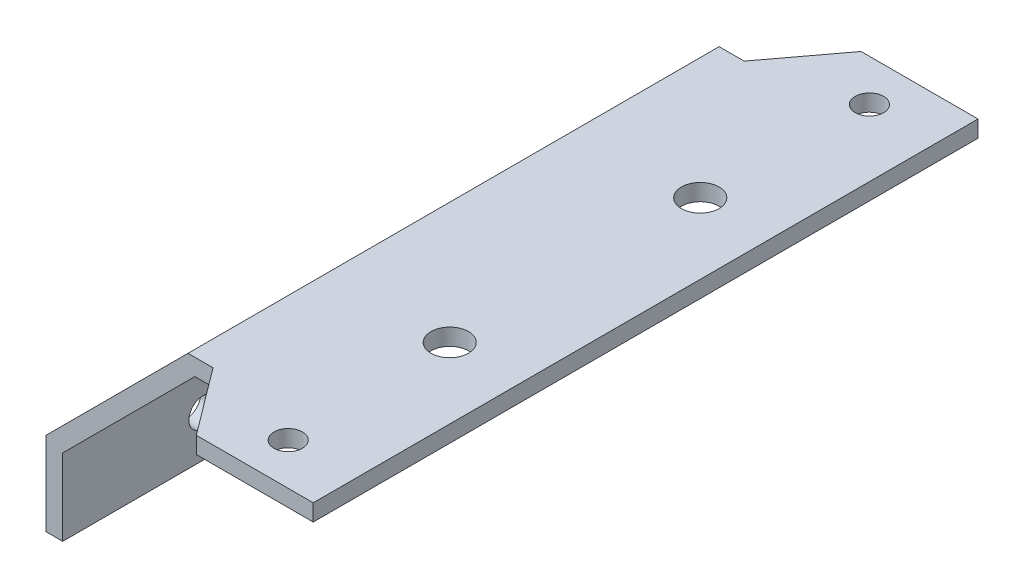
ISO-10303-21;
HEADER;
FILE_DESCRIPTION(('STEP AP214'),'2;1');
FILE_NAME('part.step','',(''),(''),'','','');
FILE_SCHEMA(('AUTOMOTIVE_DESIGN { 1 0 10303 214 1 1 1 1 }'));
ENDSEC;
DATA;
#1=APPLICATION_CONTEXT('core data for automotive mechanical design processes');
#2=APPLICATION_PROTOCOL_DEFINITION('international standard','automotive_design',2000,#1);
#3=PRODUCT_CONTEXT('',#1,'mechanical');
#4=PRODUCT('Part','Part','',(#3));
#5=PRODUCT_RELATED_PRODUCT_CATEGORY('part','',(#4));
#6=PRODUCT_DEFINITION_FORMATION('','',#4);
#7=PRODUCT_DEFINITION_CONTEXT('part definition',#1,'design');
#8=PRODUCT_DEFINITION('design','',#6,#7);
#9=PRODUCT_DEFINITION_SHAPE('','',#8);
#10=(LENGTH_UNIT() NAMED_UNIT(*) SI_UNIT(.MILLI.,.METRE.));
#11=(NAMED_UNIT(*) PLANE_ANGLE_UNIT() SI_UNIT($,.RADIAN.));
#12=(NAMED_UNIT(*) SI_UNIT($,.STERADIAN.) SOLID_ANGLE_UNIT());
#13=UNCERTAINTY_MEASURE_WITH_UNIT(LENGTH_MEASURE(1.E-05),#10,'distance_accuracy_value','');
#14=(GEOMETRIC_REPRESENTATION_CONTEXT(3) GLOBAL_UNCERTAINTY_ASSIGNED_CONTEXT((#13)) GLOBAL_UNIT_ASSIGNED_CONTEXT((#10,
#11,#12)) REPRESENTATION_CONTEXT('',''));
#15=CARTESIAN_POINT('',(0.,0.,0.));
#16=DIRECTION('',(0.,0.,1.));
#17=DIRECTION('',(1.,0.,0.));
#18=AXIS2_PLACEMENT_3D('',#15,#16,#17);
#19=CARTESIAN_POINT('',(0.,0.,-31.8));
#20=DIRECTION('',(0.,0.,1.));
#21=DIRECTION('',(1.,0.,0.));
#22=AXIS2_PLACEMENT_3D('',#19,#20,#21);
#23=PLANE('',#22);
#24=DIRECTION('',(0.,1.,0.));
#25=VECTOR('',#24,1.);
#26=CARTESIAN_POINT('',(18.,25.,-31.8));
#27=LINE('',#26,#25);
#28=CARTESIAN_POINT('',(18.,25.,-31.8));
#29=VERTEX_POINT('',#28);
#30=CARTESIAN_POINT('',(18.,27.,-31.8));
#31=VERTEX_POINT('',#30);
#32=EDGE_CURVE('E50',#29,#31,#27,.T.);
#33=ORIENTED_EDGE('',*,*,#32,.F.);
#34=DIRECTION('',(1.,0.,0.));
#35=VECTOR('',#34,1.);
#36=CARTESIAN_POINT('',(15.8284271247461,25.,-31.8));
#37=LINE('',#36,#35);
#38=CARTESIAN_POINT('',(15.8284271247461,25.,-31.8));
#39=VERTEX_POINT('',#38);
#40=EDGE_CURVE('E132',#39,#29,#37,.T.);
#41=ORIENTED_EDGE('',*,*,#40,.F.);
#42=DIRECTION('',(0.707106781186546,0.707106781186549,0.));
#43=VECTOR('',#42,1.);
#44=CARTESIAN_POINT('',(0.,9.17157287525381,-31.8));
#45=LINE('',#44,#43);
#46=CARTESIAN_POINT('',(0.,9.17157287525381,-31.8));
#47=VERTEX_POINT('',#46);
#48=EDGE_CURVE('E215',#47,#39,#45,.T.);
#49=ORIENTED_EDGE('',*,*,#48,.F.);
#50=DIRECTION('',(0.,1.,0.));
#51=VECTOR('',#50,1.);
#52=CARTESIAN_POINT('',(0.,0.,-31.8));
#53=LINE('',#52,#51);
#54=CARTESIAN_POINT('',(0.,0.,-31.8));
#55=VERTEX_POINT('',#54);
#56=EDGE_CURVE('E213',#55,#47,#53,.T.);
#57=ORIENTED_EDGE('',*,*,#56,.F.);
#58=DIRECTION('',(1.,0.,0.));
#59=VECTOR('',#58,1.);
#60=CARTESIAN_POINT('',(-2.,0.,-31.8));
#61=LINE('',#60,#59);
#62=CARTESIAN_POINT('',(-2.,0.,-31.8));
#63=VERTEX_POINT('',#62);
#64=EDGE_CURVE('E192',#63,#55,#61,.T.);
#65=ORIENTED_EDGE('',*,*,#64,.F.);
#66=DIRECTION('',(0.,-1.,0.));
#67=VECTOR('',#66,1.);
#68=CARTESIAN_POINT('',(-2.,10.,-31.8));
#69=LINE('',#68,#67);
#70=CARTESIAN_POINT('',(-2.,10.,-31.8));
#71=VERTEX_POINT('',#70);
#72=EDGE_CURVE('E197',#71,#63,#69,.T.);
#73=ORIENTED_EDGE('',*,*,#72,.F.);
#74=DIRECTION('',(-0.707106781186546,-0.707106781186549,0.));
#75=VECTOR('',#74,1.);
#76=CARTESIAN_POINT('',(14.9999999999999,27.,-31.8));
#77=LINE('',#76,#75);
#78=CARTESIAN_POINT('',(14.9999999999999,27.,-31.8));
#79=VERTEX_POINT('',#78);
#80=EDGE_CURVE('E220',#79,#71,#77,.T.);
#81=ORIENTED_EDGE('',*,*,#80,.F.);
#82=DIRECTION('',(-1.,0.,0.));
#83=VECTOR('',#82,1.);
#84=CARTESIAN_POINT('',(38.,27.,-31.8));
#85=LINE('',#84,#83);
#86=EDGE_CURVE('E218',#31,#79,#85,.T.);
#87=ORIENTED_EDGE('',*,*,#86,.F.);
#88=EDGE_LOOP('',(#33,#41,#49,#57,#65,#73,#81,#87));
#89=FACE_BOUND('',#88,.T.);
#90=ADVANCED_FACE('F33',(#89),#23,.F.);
#91=CARTESIAN_POINT('',(0.,0.,31.8));
#92=DIRECTION('',(0.,0.,1.));
#93=DIRECTION('',(1.,0.,0.));
#94=AXIS2_PLACEMENT_3D('',#91,#92,#93);
#95=PLANE('',#94);
#96=DIRECTION('',(1.,0.,0.));
#97=VECTOR('',#96,1.);
#98=CARTESIAN_POINT('',(15.8284271247461,25.,31.8));
#99=LINE('',#98,#97);
#100=CARTESIAN_POINT('',(15.8284271247461,25.,31.8));
#101=VERTEX_POINT('',#100);
#102=CARTESIAN_POINT('',(18.,25.,31.8));
#103=VERTEX_POINT('',#102);
#104=EDGE_CURVE('E201',#101,#103,#99,.T.);
#105=ORIENTED_EDGE('',*,*,#104,.T.);
#106=DIRECTION('',(0.,1.,0.));
#107=VECTOR('',#106,1.);
#108=CARTESIAN_POINT('',(18.,25.,31.8));
#109=LINE('',#108,#107);
#110=CARTESIAN_POINT('',(18.,27.,31.8));
#111=VERTEX_POINT('',#110);
#112=EDGE_CURVE('E163',#103,#111,#109,.T.);
#113=ORIENTED_EDGE('',*,*,#112,.T.);
#114=DIRECTION('',(-1.,0.,0.));
#115=VECTOR('',#114,1.);
#116=CARTESIAN_POINT('',(38.,27.,31.8));
#117=LINE('',#116,#115);
#118=CARTESIAN_POINT('',(14.9999999999999,27.,31.8));
#119=VERTEX_POINT('',#118);
#120=EDGE_CURVE('E204',#111,#119,#117,.T.);
#121=ORIENTED_EDGE('',*,*,#120,.T.);
#122=DIRECTION('',(-0.707106781186546,-0.707106781186549,0.));
#123=VECTOR('',#122,1.);
#124=CARTESIAN_POINT('',(14.9999999999999,27.,31.8));
#125=LINE('',#124,#123);
#126=CARTESIAN_POINT('',(-2.,10.,31.8));
#127=VERTEX_POINT('',#126);
#128=EDGE_CURVE('E206',#119,#127,#125,.T.);
#129=ORIENTED_EDGE('',*,*,#128,.T.);
#130=DIRECTION('',(0.,-1.,0.));
#131=VECTOR('',#130,1.);
#132=CARTESIAN_POINT('',(-2.,10.,31.8));
#133=LINE('',#132,#131);
#134=CARTESIAN_POINT('',(-2.,0.,31.8));
#135=VERTEX_POINT('',#134);
#136=EDGE_CURVE('E208',#127,#135,#133,.T.);
#137=ORIENTED_EDGE('',*,*,#136,.T.);
#138=DIRECTION('',(1.,0.,0.));
#139=VECTOR('',#138,1.);
#140=CARTESIAN_POINT('',(-2.,0.,31.8));
#141=LINE('',#140,#139);
#142=CARTESIAN_POINT('',(0.,0.,31.8));
#143=VERTEX_POINT('',#142);
#144=EDGE_CURVE('E193',#135,#143,#141,.T.);
#145=ORIENTED_EDGE('',*,*,#144,.T.);
#146=DIRECTION('',(0.,1.,0.));
#147=VECTOR('',#146,1.);
#148=CARTESIAN_POINT('',(0.,0.,31.8));
#149=LINE('',#148,#147);
#150=CARTESIAN_POINT('',(0.,9.17157287525381,31.8));
#151=VERTEX_POINT('',#150);
#152=EDGE_CURVE('E196',#143,#151,#149,.T.);
#153=ORIENTED_EDGE('',*,*,#152,.T.);
#154=DIRECTION('',(0.707106781186546,0.707106781186549,0.));
#155=VECTOR('',#154,1.);
#156=CARTESIAN_POINT('',(0.,9.17157287525381,31.8));
#157=LINE('',#156,#155);
#158=EDGE_CURVE('E199',#151,#101,#157,.T.);
#159=ORIENTED_EDGE('',*,*,#158,.T.);
#160=EDGE_LOOP('',(#105,#113,#121,#129,#137,#145,#153,#159));
#161=FACE_BOUND('',#160,.T.);
#162=ADVANCED_FACE('F260',(#161),#95,.T.);
#163=CARTESIAN_POINT('',(-2.,0.,31.8));
#164=DIRECTION('',(0.,1.,0.));
#165=DIRECTION('',(0.,0.,1.));
#166=AXIS2_PLACEMENT_3D('',#163,#164,#165);
#167=PLANE('',#166);
#168=ORIENTED_EDGE('',*,*,#64,.T.);
#169=DIRECTION('',(0.,0.,-1.));
#170=VECTOR('',#169,1.);
#171=CARTESIAN_POINT('',(0.,0.,31.8));
#172=LINE('',#171,#170);
#173=EDGE_CURVE('E11',#143,#55,#172,.T.);
#174=ORIENTED_EDGE('',*,*,#173,.F.);
#175=ORIENTED_EDGE('',*,*,#144,.F.);
#176=DIRECTION('',(0.,0.,-1.));
#177=VECTOR('',#176,1.);
#178=CARTESIAN_POINT('',(-2.,0.,31.8));
#179=LINE('',#178,#177);
#180=EDGE_CURVE('E210',#135,#63,#179,.T.);
#181=ORIENTED_EDGE('',*,*,#180,.T.);
#182=EDGE_LOOP('',(#168,#174,#175,#181));
#183=FACE_BOUND('',#182,.T.);
#184=ADVANCED_FACE('F35',(#183),#167,.F.);
#185=CARTESIAN_POINT('',(0.,0.,31.8));
#186=DIRECTION('',(-1.,0.,0.));
#187=DIRECTION('',(0.,0.,1.));
#188=AXIS2_PLACEMENT_3D('',#185,#186,#187);
#189=PLANE('',#188);
#190=CARTESIAN_POINT('',(0.,5.,-5.));
#191=DIRECTION('',(1.,0.,0.));
#192=DIRECTION('',(0.,0.,-1.));
#193=AXIS2_PLACEMENT_3D('',#190,#191,#192);
#194=CIRCLE('',#193,1.7);
#195=CARTESIAN_POINT('',(0.,5.,-6.7));
#196=VERTEX_POINT('',#195);
#197=EDGE_CURVE('E173',#196,#196,#194,.T.);
#198=ORIENTED_EDGE('',*,*,#197,.F.);
#199=EDGE_LOOP('',(#198));
#200=FACE_BOUND('',#199,.T.);
#201=CARTESIAN_POINT('',(0.,5.,5.));
#202=DIRECTION('',(1.,0.,0.));
#203=DIRECTION('',(0.,0.,-1.));
#204=AXIS2_PLACEMENT_3D('',#201,#202,#203);
#205=CIRCLE('',#204,1.7);
#206=CARTESIAN_POINT('',(0.,5.,3.3));
#207=VERTEX_POINT('',#206);
#208=EDGE_CURVE('E176',#207,#207,#205,.T.);
#209=ORIENTED_EDGE('',*,*,#208,.F.);
#210=EDGE_LOOP('',(#209));
#211=FACE_BOUND('',#210,.T.);
#212=CARTESIAN_POINT('',(0.,5.,15.));
#213=DIRECTION('',(1.,0.,0.));
#214=DIRECTION('',(0.,0.,-1.));
#215=AXIS2_PLACEMENT_3D('',#212,#213,#214);
#216=CIRCLE('',#215,1.7);
#217=CARTESIAN_POINT('',(0.,5.,13.3));
#218=VERTEX_POINT('',#217);
#219=EDGE_CURVE('E182',#218,#218,#216,.T.);
#220=ORIENTED_EDGE('',*,*,#219,.F.);
#221=EDGE_LOOP('',(#220));
#222=FACE_BOUND('',#221,.T.);
#223=CARTESIAN_POINT('',(0.,5.,-15.));
#224=DIRECTION('',(1.,0.,0.));
#225=DIRECTION('',(0.,0.,-1.));
#226=AXIS2_PLACEMENT_3D('',#223,#224,#225);
#227=CIRCLE('',#226,1.7);
#228=CARTESIAN_POINT('',(0.,5.,-16.7));
#229=VERTEX_POINT('',#228);
#230=EDGE_CURVE('E186',#229,#229,#227,.T.);
#231=ORIENTED_EDGE('',*,*,#230,.F.);
#232=EDGE_LOOP('',(#231));
#233=FACE_BOUND('',#232,.T.);
#234=ORIENTED_EDGE('',*,*,#56,.T.);
#235=DIRECTION('',(0.,0.,-1.));
#236=VECTOR('',#235,1.);
#237=CARTESIAN_POINT('',(0.,9.17157287525381,31.8));
#238=LINE('',#237,#236);
#239=EDGE_CURVE('E42',#151,#47,#238,.T.);
#240=ORIENTED_EDGE('',*,*,#239,.F.);
#241=ORIENTED_EDGE('',*,*,#152,.F.);
#242=ORIENTED_EDGE('',*,*,#173,.T.);
#243=EDGE_LOOP('',(#234,#240,#241,#242));
#244=FACE_BOUND('',#243,.T.);
#245=ADVANCED_FACE('F288',(#200,#211,#222,#233,#244),#189,.F.);
#246=CARTESIAN_POINT('',(0.,9.17157287525381,31.8));
#247=DIRECTION('',(-0.707106781186549,0.707106781186546,0.));
#248=DIRECTION('',(-0.707106781186546,-0.707106781186549,0.));
#249=AXIS2_PLACEMENT_3D('',#246,#247,#248);
#250=PLANE('',#249);
#251=ORIENTED_EDGE('',*,*,#48,.T.);
#252=DIRECTION('',(0.,0.,-1.));
#253=VECTOR('',#252,1.);
#254=CARTESIAN_POINT('',(15.8284271247461,25.,31.8));
#255=LINE('',#254,#253);
#256=EDGE_CURVE('E235',#101,#39,#255,.T.);
#257=ORIENTED_EDGE('',*,*,#256,.F.);
#258=ORIENTED_EDGE('',*,*,#158,.F.);
#259=ORIENTED_EDGE('',*,*,#239,.T.);
#260=EDGE_LOOP('',(#251,#257,#258,#259));
#261=FACE_BOUND('',#260,.T.);
#262=ADVANCED_FACE('F285',(#261),#250,.F.);
#263=CARTESIAN_POINT('',(15.8284271247461,25.,31.8));
#264=DIRECTION('',(0.,1.,0.));
#265=DIRECTION('',(0.,0.,1.));
#266=AXIS2_PLACEMENT_3D('',#263,#264,#265);
#267=PLANE('',#266);
#268=CARTESIAN_POINT('',(29.5415152253349,25.,-15.));
#269=DIRECTION('',(0.,-1.,0.));
#270=DIRECTION('',(0.,0.,-1.));
#271=AXIS2_PLACEMENT_3D('',#268,#269,#270);
#272=CIRCLE('',#271,2.25);
#273=CARTESIAN_POINT('',(29.5415152253349,25.,-17.25));
#274=VERTEX_POINT('',#273);
#275=EDGE_CURVE('E366',#274,#274,#272,.T.);
#276=ORIENTED_EDGE('',*,*,#275,.F.);
#277=EDGE_LOOP('',(#276));
#278=FACE_BOUND('',#277,.T.);
#279=CARTESIAN_POINT('',(29.5415152253349,25.,15.));
#280=DIRECTION('',(0.,-1.,0.));
#281=DIRECTION('',(0.,0.,-1.));
#282=AXIS2_PLACEMENT_3D('',#279,#280,#281);
#283=CIRCLE('',#282,2.25);
#284=CARTESIAN_POINT('',(29.5415152253349,25.,12.75));
#285=VERTEX_POINT('',#284);
#286=EDGE_CURVE('E368',#285,#285,#283,.T.);
#287=ORIENTED_EDGE('',*,*,#286,.F.);
#288=EDGE_LOOP('',(#287));
#289=FACE_BOUND('',#288,.T.);
#290=CARTESIAN_POINT('',(30.,25.,-34.8));
#291=DIRECTION('',(0.,1.,0.));
#292=DIRECTION('',(0.,0.,1.));
#293=AXIS2_PLACEMENT_3D('',#290,#291,#292);
#294=CIRCLE('',#293,1.69999999999999);
#295=CARTESIAN_POINT('',(30.,25.,-33.1));
#296=VERTEX_POINT('',#295);
#297=EDGE_CURVE('E379',#296,#296,#294,.T.);
#298=ORIENTED_EDGE('',*,*,#297,.T.);
#299=EDGE_LOOP('',(#298));
#300=FACE_BOUND('',#299,.T.);
#301=CARTESIAN_POINT('',(30.,25.,34.8));
#302=DIRECTION('',(0.,1.,0.));
#303=DIRECTION('',(0.,0.,1.));
#304=AXIS2_PLACEMENT_3D('',#301,#302,#303);
#305=CIRCLE('',#304,1.69999999999999);
#306=CARTESIAN_POINT('',(30.,25.,36.5));
#307=VERTEX_POINT('',#306);
#308=EDGE_CURVE('E153',#307,#307,#305,.T.);
#309=ORIENTED_EDGE('',*,*,#308,.T.);
#310=EDGE_LOOP('',(#309));
#311=FACE_BOUND('',#310,.T.);
#312=ORIENTED_EDGE('',*,*,#40,.T.);
#313=DIRECTION('',(0.6,0.,-0.8));
#314=VECTOR('',#313,1.);
#315=CARTESIAN_POINT('',(18.,25.,-31.8));
#316=LINE('',#315,#314);
#317=CARTESIAN_POINT('',(24.,25.,-39.8));
#318=VERTEX_POINT('',#317);
#319=EDGE_CURVE('E125',#29,#318,#316,.T.);
#320=ORIENTED_EDGE('',*,*,#319,.T.);
#321=DIRECTION('',(1.,0.,0.));
#322=VECTOR('',#321,1.);
#323=CARTESIAN_POINT('',(24.,25.,-39.8));
#324=LINE('',#323,#322);
#325=CARTESIAN_POINT('',(38.,25.,-39.8));
#326=VERTEX_POINT('',#325);
#327=EDGE_CURVE('E129',#318,#326,#324,.T.);
#328=ORIENTED_EDGE('',*,*,#327,.T.);
#329=DIRECTION('',(0.,0.,-1.));
#330=VECTOR('',#329,1.);
#331=CARTESIAN_POINT('',(38.,25.,31.8));
#332=LINE('',#331,#330);
#333=CARTESIAN_POINT('',(38.,25.,39.8));
#334=VERTEX_POINT('',#333);
#335=EDGE_CURVE('E233',#334,#326,#332,.T.);
#336=ORIENTED_EDGE('',*,*,#335,.F.);
#337=DIRECTION('',(1.,0.,0.));
#338=VECTOR('',#337,1.);
#339=CARTESIAN_POINT('',(24.,25.,39.8));
#340=LINE('',#339,#338);
#341=CARTESIAN_POINT('',(24.,25.,39.8));
#342=VERTEX_POINT('',#341);
#343=EDGE_CURVE('E157',#342,#334,#340,.T.);
#344=ORIENTED_EDGE('',*,*,#343,.F.);
#345=DIRECTION('',(0.6,0.,0.8));
#346=VECTOR('',#345,1.);
#347=CARTESIAN_POINT('',(18.,25.,31.8));
#348=LINE('',#347,#346);
#349=EDGE_CURVE('E160',#103,#342,#348,.T.);
#350=ORIENTED_EDGE('',*,*,#349,.F.);
#351=ORIENTED_EDGE('',*,*,#104,.F.);
#352=ORIENTED_EDGE('',*,*,#256,.T.);
#353=EDGE_LOOP('',(#312,#320,#328,#336,#344,#350,#351,#352));
#354=FACE_BOUND('',#353,.T.);
#355=ADVANCED_FACE('F127',(#278,#289,#300,#311,#354),#267,.F.);
#356=CARTESIAN_POINT('',(38.,25.,31.8));
#357=DIRECTION('',(-1.,0.,0.));
#358=DIRECTION('',(0.,-1.,0.));
#359=AXIS2_PLACEMENT_3D('',#356,#357,#358);
#360=PLANE('',#359);
#361=ORIENTED_EDGE('',*,*,#335,.T.);
#362=DIRECTION('',(0.,1.,0.));
#363=VECTOR('',#362,1.);
#364=CARTESIAN_POINT('',(38.,25.,-39.8));
#365=LINE('',#364,#363);
#366=CARTESIAN_POINT('',(38.,27.,-39.8));
#367=VERTEX_POINT('',#366);
#368=EDGE_CURVE('E144',#326,#367,#365,.T.);
#369=ORIENTED_EDGE('',*,*,#368,.T.);
#370=DIRECTION('',(0.,0.,-1.));
#371=VECTOR('',#370,1.);
#372=CARTESIAN_POINT('',(38.,27.,31.8));
#373=LINE('',#372,#371);
#374=CARTESIAN_POINT('',(38.,27.,39.8));
#375=VERTEX_POINT('',#374);
#376=EDGE_CURVE('E231',#375,#367,#373,.T.);
#377=ORIENTED_EDGE('',*,*,#376,.F.);
#378=DIRECTION('',(0.,1.,0.));
#379=VECTOR('',#378,1.);
#380=CARTESIAN_POINT('',(38.,25.,39.8));
#381=LINE('',#380,#379);
#382=EDGE_CURVE('E170',#334,#375,#381,.T.);
#383=ORIENTED_EDGE('',*,*,#382,.F.);
#384=EDGE_LOOP('',(#361,#369,#377,#383));
#385=FACE_BOUND('',#384,.T.);
#386=ADVANCED_FACE('F278',(#385),#360,.F.);
#387=CARTESIAN_POINT('',(38.,27.,31.8));
#388=DIRECTION('',(0.,-1.,0.));
#389=DIRECTION('',(1.,0.,0.));
#390=AXIS2_PLACEMENT_3D('',#387,#388,#389);
#391=PLANE('',#390);
#392=CARTESIAN_POINT('',(29.5415152253349,27.,-15.));
#393=DIRECTION('',(0.,-1.,0.));
#394=DIRECTION('',(0.,0.,-1.));
#395=AXIS2_PLACEMENT_3D('',#392,#393,#394);
#396=CIRCLE('',#395,2.25);
#397=CARTESIAN_POINT('',(29.5415152253349,27.,-17.25));
#398=VERTEX_POINT('',#397);
#399=EDGE_CURVE('E363',#398,#398,#396,.T.);
#400=ORIENTED_EDGE('',*,*,#399,.T.);
#401=EDGE_LOOP('',(#400));
#402=FACE_BOUND('',#401,.T.);
#403=CARTESIAN_POINT('',(29.5415152253349,27.,15.));
#404=DIRECTION('',(0.,-1.,0.));
#405=DIRECTION('',(0.,0.,-1.));
#406=AXIS2_PLACEMENT_3D('',#403,#404,#405);
#407=CIRCLE('',#406,2.25);
#408=CARTESIAN_POINT('',(29.5415152253349,27.,12.75));
#409=VERTEX_POINT('',#408);
#410=EDGE_CURVE('E373',#409,#409,#407,.T.);
#411=ORIENTED_EDGE('',*,*,#410,.T.);
#412=EDGE_LOOP('',(#411));
#413=FACE_BOUND('',#412,.T.);
#414=CARTESIAN_POINT('',(30.,27.,-34.8));
#415=DIRECTION('',(0.,1.,0.));
#416=DIRECTION('',(0.,0.,1.));
#417=AXIS2_PLACEMENT_3D('',#414,#415,#416);
#418=CIRCLE('',#417,1.69999999999999);
#419=CARTESIAN_POINT('',(30.,27.,-33.1));
#420=VERTEX_POINT('',#419);
#421=EDGE_CURVE('E376',#420,#420,#418,.T.);
#422=ORIENTED_EDGE('',*,*,#421,.F.);
#423=EDGE_LOOP('',(#422));
#424=FACE_BOUND('',#423,.T.);
#425=CARTESIAN_POINT('',(30.,27.,34.8));
#426=DIRECTION('',(0.,1.,0.));
#427=DIRECTION('',(0.,0.,1.));
#428=AXIS2_PLACEMENT_3D('',#425,#426,#427);
#429=CIRCLE('',#428,1.69999999999999);
#430=CARTESIAN_POINT('',(30.,27.,36.5));
#431=VERTEX_POINT('',#430);
#432=EDGE_CURVE('E382',#431,#431,#429,.T.);
#433=ORIENTED_EDGE('',*,*,#432,.F.);
#434=EDGE_LOOP('',(#433));
#435=FACE_BOUND('',#434,.T.);
#436=ORIENTED_EDGE('',*,*,#376,.T.);
#437=DIRECTION('',(1.,0.,0.));
#438=VECTOR('',#437,1.);
#439=CARTESIAN_POINT('',(24.,27.,-39.8));
#440=LINE('',#439,#438);
#441=CARTESIAN_POINT('',(24.,27.,-39.8));
#442=VERTEX_POINT('',#441);
#443=EDGE_CURVE('E134',#442,#367,#440,.T.);
#444=ORIENTED_EDGE('',*,*,#443,.F.);
#445=DIRECTION('',(0.6,0.,-0.8));
#446=VECTOR('',#445,1.);
#447=CARTESIAN_POINT('',(18.,27.,-31.8));
#448=LINE('',#447,#446);
#449=EDGE_CURVE('E140',#31,#442,#448,.T.);
#450=ORIENTED_EDGE('',*,*,#449,.F.);
#451=ORIENTED_EDGE('',*,*,#86,.T.);
#452=DIRECTION('',(0.,0.,-1.));
#453=VECTOR('',#452,1.);
#454=CARTESIAN_POINT('',(14.9999999999999,27.,31.8));
#455=LINE('',#454,#453);
#456=EDGE_CURVE('E228',#119,#79,#455,.T.);
#457=ORIENTED_EDGE('',*,*,#456,.F.);
#458=ORIENTED_EDGE('',*,*,#120,.F.);
#459=DIRECTION('',(0.6,0.,0.8));
#460=VECTOR('',#459,1.);
#461=CARTESIAN_POINT('',(18.,27.,31.8));
#462=LINE('',#461,#460);
#463=CARTESIAN_POINT('',(24.,27.,39.8));
#464=VERTEX_POINT('',#463);
#465=EDGE_CURVE('E58',#111,#464,#462,.T.);
#466=ORIENTED_EDGE('',*,*,#465,.T.);
#467=DIRECTION('',(1.,0.,0.));
#468=VECTOR('',#467,1.);
#469=CARTESIAN_POINT('',(24.,27.,39.8));
#470=LINE('',#469,#468);
#471=EDGE_CURVE('E156',#464,#375,#470,.T.);
#472=ORIENTED_EDGE('',*,*,#471,.T.);
#473=EDGE_LOOP('',(#436,#444,#450,#451,#457,#458,#466,#472));
#474=FACE_BOUND('',#473,.T.);
#475=ADVANCED_FACE('F274',(#402,#413,#424,#435,#474),#391,.F.);
#476=CARTESIAN_POINT('',(14.9999999999999,27.,31.8));
#477=DIRECTION('',(0.707106781186549,-0.707106781186546,0.));
#478=DIRECTION('',(0.707106781186546,0.707106781186549,0.));
#479=AXIS2_PLACEMENT_3D('',#476,#477,#478);
#480=PLANE('',#479);
#481=ORIENTED_EDGE('',*,*,#80,.T.);
#482=DIRECTION('',(0.,0.,-1.));
#483=VECTOR('',#482,1.);
#484=CARTESIAN_POINT('',(-2.,10.,31.8));
#485=LINE('',#484,#483);
#486=EDGE_CURVE('E225',#127,#71,#485,.T.);
#487=ORIENTED_EDGE('',*,*,#486,.F.);
#488=ORIENTED_EDGE('',*,*,#128,.F.);
#489=ORIENTED_EDGE('',*,*,#456,.T.);
#490=EDGE_LOOP('',(#481,#487,#488,#489));
#491=FACE_BOUND('',#490,.T.);
#492=ADVANCED_FACE('F270',(#491),#480,.F.);
#493=CARTESIAN_POINT('',(-2.,10.,31.8));
#494=DIRECTION('',(1.,0.,0.));
#495=DIRECTION('',(0.,1.,0.));
#496=AXIS2_PLACEMENT_3D('',#493,#494,#495);
#497=PLANE('',#496);
#498=CARTESIAN_POINT('',(-2.,5.,-5.));
#499=DIRECTION('',(1.,0.,0.));
#500=DIRECTION('',(0.,1.,0.));
#501=AXIS2_PLACEMENT_3D('',#498,#499,#500);
#502=CIRCLE('',#501,1.7);
#503=CARTESIAN_POINT('',(-2.,6.7,-5.));
#504=VERTEX_POINT('',#503);
#505=EDGE_CURVE('E37',#504,#504,#502,.T.);
#506=ORIENTED_EDGE('',*,*,#505,.T.);
#507=EDGE_LOOP('',(#506));
#508=FACE_BOUND('',#507,.T.);
#509=CARTESIAN_POINT('',(-2.,5.,5.));
#510=DIRECTION('',(1.,0.,0.));
#511=DIRECTION('',(0.,1.,0.));
#512=AXIS2_PLACEMENT_3D('',#509,#510,#511);
#513=CIRCLE('',#512,1.7);
#514=CARTESIAN_POINT('',(-2.,6.7,5.));
#515=VERTEX_POINT('',#514);
#516=EDGE_CURVE('E179',#515,#515,#513,.T.);
#517=ORIENTED_EDGE('',*,*,#516,.T.);
#518=EDGE_LOOP('',(#517));
#519=FACE_BOUND('',#518,.T.);
#520=CARTESIAN_POINT('',(-2.,5.,15.));
#521=DIRECTION('',(1.,0.,0.));
#522=DIRECTION('',(0.,1.,0.));
#523=AXIS2_PLACEMENT_3D('',#520,#521,#522);
#524=CIRCLE('',#523,1.7);
#525=CARTESIAN_POINT('',(-2.,6.7,15.));
#526=VERTEX_POINT('',#525);
#527=EDGE_CURVE('E185',#526,#526,#524,.T.);
#528=ORIENTED_EDGE('',*,*,#527,.T.);
#529=EDGE_LOOP('',(#528));
#530=FACE_BOUND('',#529,.T.);
#531=CARTESIAN_POINT('',(-2.,5.,-15.));
#532=DIRECTION('',(1.,0.,0.));
#533=DIRECTION('',(0.,1.,0.));
#534=AXIS2_PLACEMENT_3D('',#531,#532,#533);
#535=CIRCLE('',#534,1.7);
#536=CARTESIAN_POINT('',(-2.,6.7,-15.));
#537=VERTEX_POINT('',#536);
#538=EDGE_CURVE('E189',#537,#537,#535,.T.);
#539=ORIENTED_EDGE('',*,*,#538,.T.);
#540=EDGE_LOOP('',(#539));
#541=FACE_BOUND('',#540,.T.);
#542=ORIENTED_EDGE('',*,*,#72,.T.);
#543=ORIENTED_EDGE('',*,*,#180,.F.);
#544=ORIENTED_EDGE('',*,*,#136,.F.);
#545=ORIENTED_EDGE('',*,*,#486,.T.);
#546=EDGE_LOOP('',(#542,#543,#544,#545));
#547=FACE_BOUND('',#546,.T.);
#548=ADVANCED_FACE('F241',(#508,#519,#530,#541,#547),#497,.F.);
#549=CARTESIAN_POINT('',(0.,5.,-15.));
#550=DIRECTION('',(1.,0.,0.));
#551=DIRECTION('',(0.,0.,-1.));
#552=AXIS2_PLACEMENT_3D('',#549,#550,#551);
#553=CYLINDRICAL_SURFACE('',#552,1.7);
#554=ORIENTED_EDGE('',*,*,#230,.T.);
#555=EDGE_LOOP('',(#554));
#556=FACE_BOUND('',#555,.T.);
#557=ORIENTED_EDGE('',*,*,#538,.F.);
#558=EDGE_LOOP('',(#557));
#559=FACE_BOUND('',#558,.T.);
#560=ADVANCED_FACE('F247',(#556,#559),#553,.F.);
#561=CARTESIAN_POINT('',(0.,5.,15.));
#562=DIRECTION('',(1.,0.,0.));
#563=DIRECTION('',(0.,0.,-1.));
#564=AXIS2_PLACEMENT_3D('',#561,#562,#563);
#565=CYLINDRICAL_SURFACE('',#564,1.7);
#566=ORIENTED_EDGE('',*,*,#219,.T.);
#567=EDGE_LOOP('',(#566));
#568=FACE_BOUND('',#567,.T.);
#569=ORIENTED_EDGE('',*,*,#527,.F.);
#570=EDGE_LOOP('',(#569));
#571=FACE_BOUND('',#570,.T.);
#572=ADVANCED_FACE('F244',(#568,#571),#565,.F.);
#573=CARTESIAN_POINT('',(0.,5.,5.));
#574=DIRECTION('',(1.,0.,0.));
#575=DIRECTION('',(0.,0.,-1.));
#576=AXIS2_PLACEMENT_3D('',#573,#574,#575);
#577=CYLINDRICAL_SURFACE('',#576,1.7);
#578=ORIENTED_EDGE('',*,*,#208,.T.);
#579=EDGE_LOOP('',(#578));
#580=FACE_BOUND('',#579,.T.);
#581=ORIENTED_EDGE('',*,*,#516,.F.);
#582=EDGE_LOOP('',(#581));
#583=FACE_BOUND('',#582,.T.);
#584=ADVANCED_FACE('F246',(#580,#583),#577,.F.);
#585=CARTESIAN_POINT('',(0.,5.,-5.));
#586=DIRECTION('',(1.,0.,0.));
#587=DIRECTION('',(0.,0.,-1.));
#588=AXIS2_PLACEMENT_3D('',#585,#586,#587);
#589=CYLINDRICAL_SURFACE('',#588,1.7);
#590=ORIENTED_EDGE('',*,*,#197,.T.);
#591=EDGE_LOOP('',(#590));
#592=FACE_BOUND('',#591,.T.);
#593=ORIENTED_EDGE('',*,*,#505,.F.);
#594=EDGE_LOOP('',(#593));
#595=FACE_BOUND('',#594,.T.);
#596=ADVANCED_FACE('F254',(#592,#595),#589,.F.);
#597=CARTESIAN_POINT('',(24.,25.,39.8));
#598=DIRECTION('',(0.,0.,1.));
#599=DIRECTION('',(1.,0.,0.));
#600=AXIS2_PLACEMENT_3D('',#597,#598,#599);
#601=PLANE('',#600);
#602=ORIENTED_EDGE('',*,*,#471,.F.);
#603=DIRECTION('',(0.,1.,0.));
#604=VECTOR('',#603,1.);
#605=CARTESIAN_POINT('',(24.,25.,39.8));
#606=LINE('',#605,#604);
#607=EDGE_CURVE('E168',#342,#464,#606,.T.);
#608=ORIENTED_EDGE('',*,*,#607,.F.);
#609=ORIENTED_EDGE('',*,*,#343,.T.);
#610=ORIENTED_EDGE('',*,*,#382,.T.);
#611=EDGE_LOOP('',(#602,#608,#609,#610));
#612=FACE_BOUND('',#611,.T.);
#613=ADVANCED_FACE('F328',(#612),#601,.T.);
#614=CARTESIAN_POINT('',(18.,25.,31.8));
#615=DIRECTION('',(-0.8,0.,0.6));
#616=DIRECTION('',(0.6,0.,0.8));
#617=AXIS2_PLACEMENT_3D('',#614,#615,#616);
#618=PLANE('',#617);
#619=ORIENTED_EDGE('',*,*,#465,.F.);
#620=ORIENTED_EDGE('',*,*,#112,.F.);
#621=ORIENTED_EDGE('',*,*,#349,.T.);
#622=ORIENTED_EDGE('',*,*,#607,.T.);
#623=EDGE_LOOP('',(#619,#620,#621,#622));
#624=FACE_BOUND('',#623,.T.);
#625=ADVANCED_FACE('F326',(#624),#618,.T.);
#626=CARTESIAN_POINT('',(18.,25.,-31.8));
#627=DIRECTION('',(0.8,0.,0.6));
#628=DIRECTION('',(0.6,0.,-0.8));
#629=AXIS2_PLACEMENT_3D('',#626,#627,#628);
#630=PLANE('',#629);
#631=ORIENTED_EDGE('',*,*,#449,.T.);
#632=DIRECTION('',(0.,1.,0.));
#633=VECTOR('',#632,1.);
#634=CARTESIAN_POINT('',(24.,25.,-39.8));
#635=LINE('',#634,#633);
#636=EDGE_CURVE('E137',#318,#442,#635,.T.);
#637=ORIENTED_EDGE('',*,*,#636,.F.);
#638=ORIENTED_EDGE('',*,*,#319,.F.);
#639=ORIENTED_EDGE('',*,*,#32,.T.);
#640=EDGE_LOOP('',(#631,#637,#638,#639));
#641=FACE_BOUND('',#640,.T.);
#642=ADVANCED_FACE('F138',(#641),#630,.F.);
#643=CARTESIAN_POINT('',(24.,25.,-39.8));
#644=DIRECTION('',(0.,0.,1.));
#645=DIRECTION('',(1.,0.,0.));
#646=AXIS2_PLACEMENT_3D('',#643,#644,#645);
#647=PLANE('',#646);
#648=ORIENTED_EDGE('',*,*,#443,.T.);
#649=ORIENTED_EDGE('',*,*,#368,.F.);
#650=ORIENTED_EDGE('',*,*,#327,.F.);
#651=ORIENTED_EDGE('',*,*,#636,.T.);
#652=EDGE_LOOP('',(#648,#649,#650,#651));
#653=FACE_BOUND('',#652,.T.);
#654=ADVANCED_FACE('F146',(#653),#647,.F.);
#655=CARTESIAN_POINT('',(30.,27.,34.8));
#656=DIRECTION('',(0.,1.,0.));
#657=DIRECTION('',(0.,0.,1.));
#658=AXIS2_PLACEMENT_3D('',#655,#656,#657);
#659=CYLINDRICAL_SURFACE('',#658,1.69999999999999);
#660=ORIENTED_EDGE('',*,*,#432,.T.);
#661=EDGE_LOOP('',(#660));
#662=FACE_BOUND('',#661,.T.);
#663=ORIENTED_EDGE('',*,*,#308,.F.);
#664=EDGE_LOOP('',(#663));
#665=FACE_BOUND('',#664,.T.);
#666=ADVANCED_FACE('F343',(#662,#665),#659,.F.);
#667=CARTESIAN_POINT('',(30.,27.,-34.8));
#668=DIRECTION('',(0.,1.,0.));
#669=DIRECTION('',(0.,0.,1.));
#670=AXIS2_PLACEMENT_3D('',#667,#668,#669);
#671=CYLINDRICAL_SURFACE('',#670,1.69999999999999);
#672=ORIENTED_EDGE('',*,*,#421,.T.);
#673=EDGE_LOOP('',(#672));
#674=FACE_BOUND('',#673,.T.);
#675=ORIENTED_EDGE('',*,*,#297,.F.);
#676=EDGE_LOOP('',(#675));
#677=FACE_BOUND('',#676,.T.);
#678=ADVANCED_FACE('F346',(#674,#677),#671,.F.);
#679=CARTESIAN_POINT('',(29.5415152253349,25.,15.));
#680=DIRECTION('',(0.,-1.,0.));
#681=DIRECTION('',(0.,0.,-1.));
#682=AXIS2_PLACEMENT_3D('',#679,#680,#681);
#683=CYLINDRICAL_SURFACE('',#682,2.25);
#684=ORIENTED_EDGE('',*,*,#410,.F.);
#685=EDGE_LOOP('',(#684));
#686=FACE_BOUND('',#685,.T.);
#687=ORIENTED_EDGE('',*,*,#286,.T.);
#688=EDGE_LOOP('',(#687));
#689=FACE_BOUND('',#688,.T.);
#690=ADVANCED_FACE('F350',(#686,#689),#683,.F.);
#691=CARTESIAN_POINT('',(29.5415152253349,25.,-15.));
#692=DIRECTION('',(0.,-1.,0.));
#693=DIRECTION('',(0.,0.,-1.));
#694=AXIS2_PLACEMENT_3D('',#691,#692,#693);
#695=CYLINDRICAL_SURFACE('',#694,2.25);
#696=ORIENTED_EDGE('',*,*,#399,.F.);
#697=EDGE_LOOP('',(#696));
#698=FACE_BOUND('',#697,.T.);
#699=ORIENTED_EDGE('',*,*,#275,.T.);
#700=EDGE_LOOP('',(#699));
#701=FACE_BOUND('',#700,.T.);
#702=ADVANCED_FACE('F354',(#698,#701),#695,.F.);
#703=CLOSED_SHELL('',(#90,#162,#184,#245,#262,#355,#386,#475,#492,#548,#560,#572,#584,#596,#613,
#625,#642,#654,#666,#678,#690,#702));
#704=MANIFOLD_SOLID_BREP('B2',#703);
#705=ADVANCED_BREP_SHAPE_REPRESENTATION('',(#18,#704),#14);
#706=SHAPE_DEFINITION_REPRESENTATION(#9,#705);
ENDSEC;
END-ISO-10303-21;
